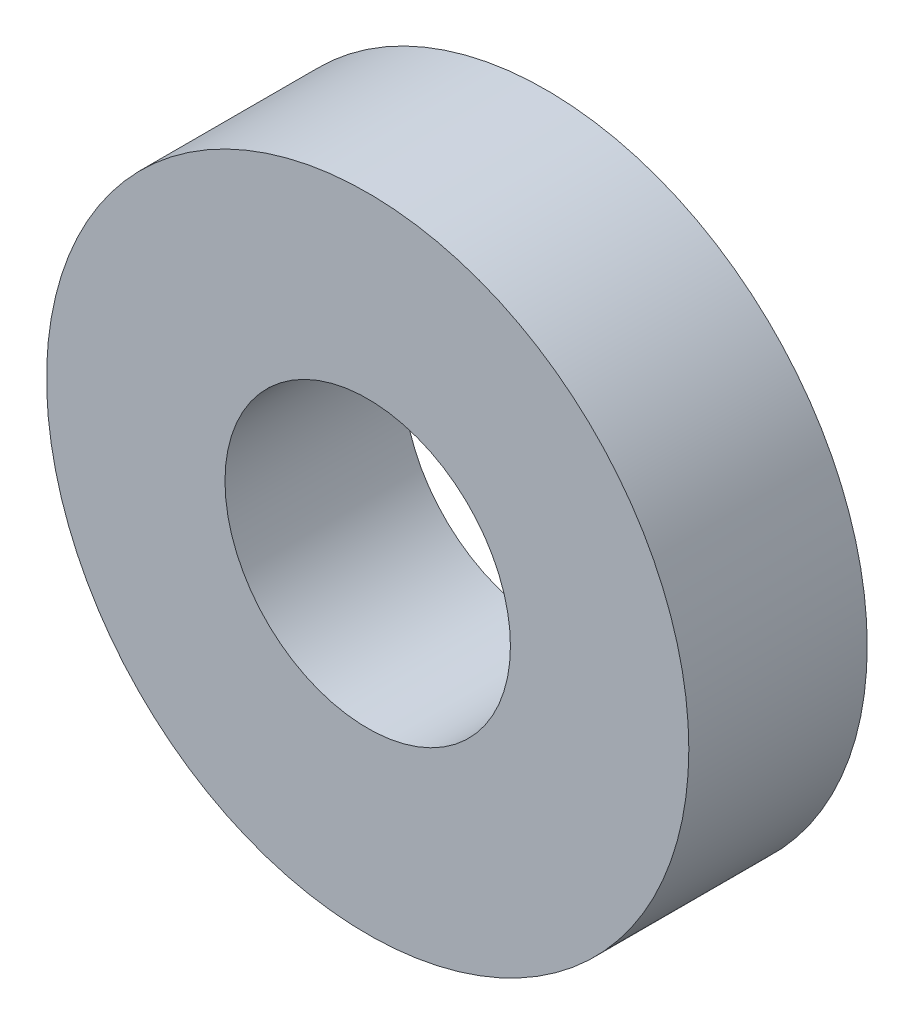
ISO-10303-21;
HEADER;
FILE_DESCRIPTION(('STEP AP214'),'2;1');
FILE_NAME('part.step','',(''),(''),'','','');
FILE_SCHEMA(('AUTOMOTIVE_DESIGN { 1 0 10303 214 1 1 1 1 }'));
ENDSEC;
DATA;
#1=APPLICATION_CONTEXT('core data for automotive mechanical design processes');
#2=APPLICATION_PROTOCOL_DEFINITION('international standard','automotive_design',2000,#1);
#3=PRODUCT_CONTEXT('',#1,'mechanical');
#4=PRODUCT('Part','Part','',(#3));
#5=PRODUCT_RELATED_PRODUCT_CATEGORY('part','',(#4));
#6=PRODUCT_DEFINITION_FORMATION('','',#4);
#7=PRODUCT_DEFINITION_CONTEXT('part definition',#1,'design');
#8=PRODUCT_DEFINITION('design','',#6,#7);
#9=PRODUCT_DEFINITION_SHAPE('','',#8);
#10=(LENGTH_UNIT() NAMED_UNIT(*) SI_UNIT(.MILLI.,.METRE.));
#11=(NAMED_UNIT(*) PLANE_ANGLE_UNIT() SI_UNIT($,.RADIAN.));
#12=(NAMED_UNIT(*) SI_UNIT($,.STERADIAN.) SOLID_ANGLE_UNIT());
#13=UNCERTAINTY_MEASURE_WITH_UNIT(LENGTH_MEASURE(1.E-05),#10,'distance_accuracy_value','');
#14=(GEOMETRIC_REPRESENTATION_CONTEXT(3) GLOBAL_UNCERTAINTY_ASSIGNED_CONTEXT((#13)) GLOBAL_UNIT_ASSIGNED_CONTEXT((#10,
#11,#12)) REPRESENTATION_CONTEXT('',''));
#15=CARTESIAN_POINT('',(0.,0.,0.));
#16=DIRECTION('',(0.,0.,1.));
#17=DIRECTION('',(1.,0.,0.));
#18=AXIS2_PLACEMENT_3D('',#15,#16,#17);
#19=CARTESIAN_POINT('',(0.,0.,2.5));
#20=DIRECTION('',(0.,0.,1.));
#21=DIRECTION('',(1.,0.,0.));
#22=AXIS2_PLACEMENT_3D('',#19,#20,#21);
#23=PLANE('',#22);
#24=CARTESIAN_POINT('',(0.,0.,2.5));
#25=DIRECTION('',(0.,0.,1.));
#26=DIRECTION('',(1.,0.,0.));
#27=AXIS2_PLACEMENT_3D('',#24,#25,#26);
#28=CIRCLE('',#27,4.5);
#29=CARTESIAN_POINT('',(4.5,0.,2.5));
#30=VERTEX_POINT('',#29);
#31=EDGE_CURVE('E10',#30,#30,#28,.T.);
#32=ORIENTED_EDGE('',*,*,#31,.T.);
#33=EDGE_LOOP('',(#32));
#34=FACE_BOUND('',#33,.T.);
#35=CARTESIAN_POINT('',(0.,0.,2.5));
#36=DIRECTION('',(0.,0.,1.));
#37=DIRECTION('',(1.,0.,0.));
#38=AXIS2_PLACEMENT_3D('',#35,#36,#37);
#39=CIRCLE('',#38,2.);
#40=CARTESIAN_POINT('',(2.,0.,2.5));
#41=VERTEX_POINT('',#40);
#42=EDGE_CURVE('E50',#41,#41,#39,.T.);
#43=ORIENTED_EDGE('',*,*,#42,.F.);
#44=EDGE_LOOP('',(#43));
#45=FACE_BOUND('',#44,.T.);
#46=ADVANCED_FACE('F37',(#34,#45),#23,.T.);
#47=CARTESIAN_POINT('',(0.,0.,0.));
#48=DIRECTION('',(0.,0.,1.));
#49=DIRECTION('',(1.,0.,0.));
#50=AXIS2_PLACEMENT_3D('',#47,#48,#49);
#51=PLANE('',#50);
#52=CARTESIAN_POINT('',(0.,0.,0.));
#53=DIRECTION('',(0.,0.,1.));
#54=DIRECTION('',(1.,0.,0.));
#55=AXIS2_PLACEMENT_3D('',#52,#53,#54);
#56=CIRCLE('',#55,4.5);
#57=CARTESIAN_POINT('',(4.5,0.,0.));
#58=VERTEX_POINT('',#57);
#59=EDGE_CURVE('E41',#58,#58,#56,.T.);
#60=ORIENTED_EDGE('',*,*,#59,.F.);
#61=EDGE_LOOP('',(#60));
#62=FACE_BOUND('',#61,.T.);
#63=CARTESIAN_POINT('',(0.,0.,0.));
#64=DIRECTION('',(0.,0.,1.));
#65=DIRECTION('',(1.,0.,0.));
#66=AXIS2_PLACEMENT_3D('',#63,#64,#65);
#67=CIRCLE('',#66,2.);
#68=CARTESIAN_POINT('',(2.,0.,0.));
#69=VERTEX_POINT('',#68);
#70=EDGE_CURVE('E52',#69,#69,#67,.T.);
#71=ORIENTED_EDGE('',*,*,#70,.T.);
#72=EDGE_LOOP('',(#71));
#73=FACE_BOUND('',#72,.T.);
#74=ADVANCED_FACE('F64',(#62,#73),#51,.F.);
#75=CARTESIAN_POINT('',(0.,0.,2.5));
#76=DIRECTION('',(0.,0.,-1.));
#77=DIRECTION('',(-1.,0.,0.));
#78=AXIS2_PLACEMENT_3D('',#75,#76,#77);
#79=CYLINDRICAL_SURFACE('',#78,4.5);
#80=ORIENTED_EDGE('',*,*,#31,.F.);
#81=EDGE_LOOP('',(#80));
#82=FACE_BOUND('',#81,.T.);
#83=ORIENTED_EDGE('',*,*,#59,.T.);
#84=EDGE_LOOP('',(#83));
#85=FACE_BOUND('',#84,.T.);
#86=ADVANCED_FACE('F39',(#82,#85),#79,.T.);
#87=CARTESIAN_POINT('',(0.,0.,2.5));
#88=DIRECTION('',(0.,0.,-1.));
#89=DIRECTION('',(-1.,0.,0.));
#90=AXIS2_PLACEMENT_3D('',#87,#88,#89);
#91=CYLINDRICAL_SURFACE('',#90,2.);
#92=ORIENTED_EDGE('',*,*,#42,.T.);
#93=EDGE_LOOP('',(#92));
#94=FACE_BOUND('',#93,.T.);
#95=ORIENTED_EDGE('',*,*,#70,.F.);
#96=EDGE_LOOP('',(#95));
#97=FACE_BOUND('',#96,.T.);
#98=ADVANCED_FACE('F60',(#94,#97),#91,.F.);
#99=CLOSED_SHELL('',(#46,#74,#86,#98));
#100=MANIFOLD_SOLID_BREP('B2',#99);
#101=ADVANCED_BREP_SHAPE_REPRESENTATION('',(#18,#100),#14);
#102=SHAPE_DEFINITION_REPRESENTATION(#9,#101);
ENDSEC;
END-ISO-10303-21;
